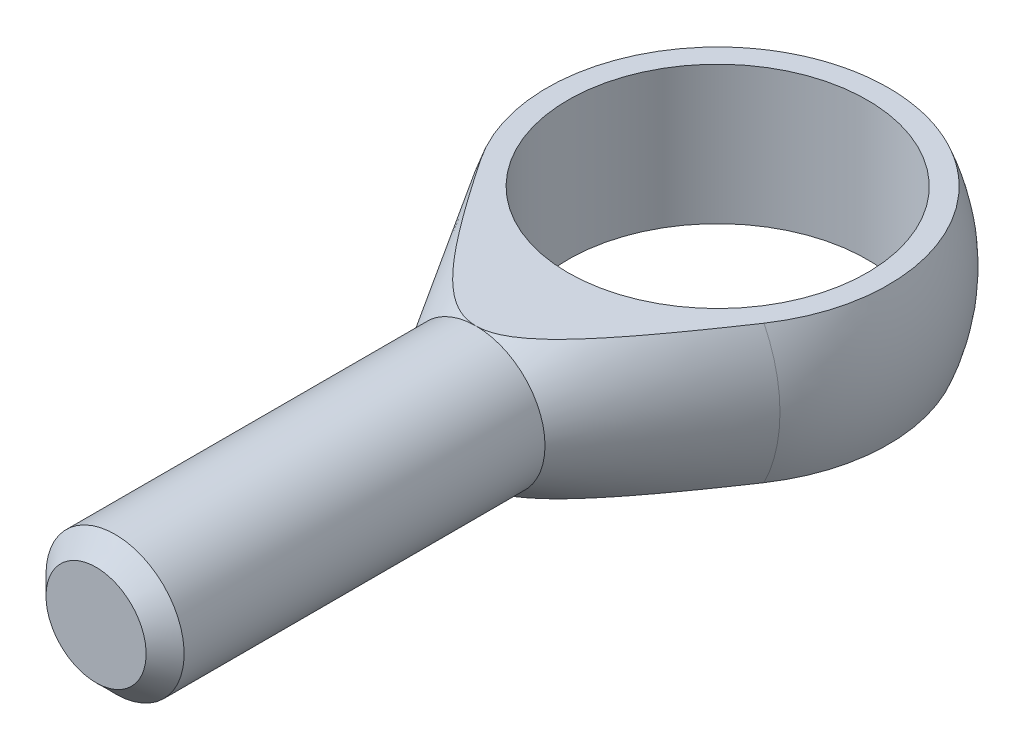
ISO-10303-21;
HEADER;
FILE_DESCRIPTION(('STEP AP214'),'2;1');
FILE_NAME('part.step','',(''),(''),'','','');
FILE_SCHEMA(('AUTOMOTIVE_DESIGN { 1 0 10303 214 1 1 1 1 }'));
ENDSEC;
DATA;
#1=APPLICATION_CONTEXT('core data for automotive mechanical design processes');
#2=APPLICATION_PROTOCOL_DEFINITION('international standard','automotive_design',2000,#1);
#3=PRODUCT_CONTEXT('',#1,'mechanical');
#4=PRODUCT('Part','Part','',(#3));
#5=PRODUCT_RELATED_PRODUCT_CATEGORY('part','',(#4));
#6=PRODUCT_DEFINITION_FORMATION('','',#4);
#7=PRODUCT_DEFINITION_CONTEXT('part definition',#1,'design');
#8=PRODUCT_DEFINITION('design','',#6,#7);
#9=PRODUCT_DEFINITION_SHAPE('','',#8);
#10=(LENGTH_UNIT() NAMED_UNIT(*) SI_UNIT(.MILLI.,.METRE.));
#11=(NAMED_UNIT(*) PLANE_ANGLE_UNIT() SI_UNIT($,.RADIAN.));
#12=(NAMED_UNIT(*) SI_UNIT($,.STERADIAN.) SOLID_ANGLE_UNIT());
#13=UNCERTAINTY_MEASURE_WITH_UNIT(LENGTH_MEASURE(1.E-05),#10,'distance_accuracy_value','');
#14=(GEOMETRIC_REPRESENTATION_CONTEXT(3) GLOBAL_UNCERTAINTY_ASSIGNED_CONTEXT((#13)) GLOBAL_UNIT_ASSIGNED_CONTEXT((#10,
#11,#12)) REPRESENTATION_CONTEXT('',''));
#15=CARTESIAN_POINT('',(0.,0.,0.));
#16=DIRECTION('',(0.,0.,1.));
#17=DIRECTION('',(1.,0.,0.));
#18=AXIS2_PLACEMENT_3D('',#15,#16,#17);
#19=CARTESIAN_POINT('',(0.,0.,21.));
#20=DIRECTION('',(0.,0.,-1.));
#21=DIRECTION('',(-1.,0.,0.));
#22=AXIS2_PLACEMENT_3D('',#19,#20,#21);
#23=CONICAL_SURFACE('',#22,6.,0.54381913603572);
#24=CARTESIAN_POINT('',(0.,0.,8.27852704456483));
#25=DIRECTION('',(0.,0.,-1.));
#26=DIRECTION('',(-1.,0.,0.));
#27=AXIS2_PLACEMENT_3D('',#24,#25,#26);
#28=CIRCLE('',#27,13.6918220106898);
#29=CARTESIAN_POINT('',(-12.3071519846148,-6.,8.27852704456483));
#30=VERTEX_POINT('',#29);
#31=CARTESIAN_POINT('',(-12.3071519846148,6.,8.27852704456483));
#32=VERTEX_POINT('',#31);
#33=EDGE_CURVE('E98',#30,#32,#28,.T.);
#34=ORIENTED_EDGE('',*,*,#33,.F.);
#35=CARTESIAN_POINT('',(-31.3799882104958,-6.,-21.9160405435385));
#36=CARTESIAN_POINT('',(-30.9346155893106,-6.,-21.1925500495504));
#37=CARTESIAN_POINT('',(-30.4890034582179,-6.,-20.4692070155686));
#38=CARTESIAN_POINT('',(-29.5972262334052,-6.,-19.022861540835));
#39=CARTESIAN_POINT('',(-29.1510611394851,-6.,-18.2998591002066));
#40=CARTESIAN_POINT('',(-27.8115766615616,-6.,-16.1313521166251));
#41=CARTESIAN_POINT('',(-26.9173172646921,-6.,-14.6864278449652));
#42=CARTESIAN_POINT('',(-25.1235923096148,-6.,-11.7956444903462));
#43=CARTESIAN_POINT('',(-24.2241197878063,-6.,-10.3497897269972));
#44=CARTESIAN_POINT('',(-22.4206158394495,-6.,-7.46102313765912));
#45=CARTESIAN_POINT('',(-21.5165846430345,-6.,-6.01811116817422));
#46=CARTESIAN_POINT('',(-20.126860696282,-6.,-3.81129437405455));
#47=CARTESIAN_POINT('',(-19.6435464141357,-6.,-3.04589194963399));
#48=CARTESIAN_POINT('',(-18.6745854110955,-6.,-1.51656533446917));
#49=CARTESIAN_POINT('',(-18.1889386929651,-6.,-0.75264114197502));
#50=CARTESIAN_POINT('',(-17.2146421972767,-6.,0.773463680413597));
#51=CARTESIAN_POINT('',(-16.7259919498118,-6.,1.53564401048951));
#52=CARTESIAN_POINT('',(-15.7449501334085,-6.,3.05758567398117));
#53=CARTESIAN_POINT('',(-15.2525585992186,-6.,3.81734702977121));
#54=CARTESIAN_POINT('',(-14.2634801806534,-6.,5.33272583238984));
#55=CARTESIAN_POINT('',(-13.766799392861,-6.,6.08834725487742));
#56=CARTESIAN_POINT('',(-12.7668366966786,-6.,7.59526672419474));
#57=CARTESIAN_POINT('',(-12.2635545265885,-6.,8.34656459791599));
#58=CARTESIAN_POINT('',(-11.5017822788204,-6.,9.46871748550414));
#59=CARTESIAN_POINT('',(-11.2467510177423,-6.,9.84192022113506));
#60=CARTESIAN_POINT('',(-10.7339025234583,-6.,10.5864052204217));
#61=CARTESIAN_POINT('',(-10.4760853093945,-6.,10.9576874972468));
#62=CARTESIAN_POINT('',(-9.95708575881299,-6.,11.6978551503882));
#63=CARTESIAN_POINT('',(-9.69590366612362,-6.,12.0667406974964));
#64=CARTESIAN_POINT('',(-9.16937247619287,-6.,12.8015219736493));
#65=CARTESIAN_POINT('',(-8.90402346502942,-6.,13.1674177642181));
#66=CARTESIAN_POINT('',(-8.460014194362,-6.,13.7704906969663));
#67=CARTESIAN_POINT('',(-8.28284323101851,-6.,14.0087640172321));
#68=CARTESIAN_POINT('',(-7.92583684483059,-6.,14.48331778095));
#69=CARTESIAN_POINT('',(-7.74600136081962,-6.,14.7195981784568));
#70=CARTESIAN_POINT('',(-7.38305426531327,-6.,15.1898992353419));
#71=CARTESIAN_POINT('',(-7.19994043221562,-6.,15.4239181830393));
#72=CARTESIAN_POINT('',(-6.82994411624043,-6.,15.8889550963289));
#73=CARTESIAN_POINT('',(-6.64306172541067,-6.,16.1199731349927));
#74=CARTESIAN_POINT('',(-6.26537430423413,-6.,16.577467845376));
#75=CARTESIAN_POINT('',(-6.07458481474136,-6.,16.803957312042));
#76=CARTESIAN_POINT('',(-5.68745941935048,-6.,17.2521406916316));
#77=CARTESIAN_POINT('',(-5.49112386393112,-6.,17.4738349060306));
#78=CARTESIAN_POINT('',(-5.09175015278233,-6.,17.910725013741));
#79=CARTESIAN_POINT('',(-4.88871884774234,-6.,18.125927142489));
#80=CARTESIAN_POINT('',(-4.47404371281153,-6.,18.5478259059901));
#81=CARTESIAN_POINT('',(-4.26240251355695,-6.,18.7545251004523));
#82=CARTESIAN_POINT('',(-3.88946376517466,-6.,19.0993151487996));
#83=CARTESIAN_POINT('',(-3.73084066141112,-6.,19.240287631417));
#84=CARTESIAN_POINT('',(-3.40674953052468,-6.,19.5143095980893));
#85=CARTESIAN_POINT('',(-3.24127918962299,-6.,19.6473563662652));
#86=CARTESIAN_POINT('',(-2.90281116121088,-6.,19.9024579565511));
#87=CARTESIAN_POINT('',(-2.72983943598837,-6.,20.024546803352));
#88=CARTESIAN_POINT('',(-2.37476302906092,-6.,20.2544269996832));
#89=CARTESIAN_POINT('',(-2.19266585087034,-6.,20.3622298385993));
#90=CARTESIAN_POINT('',(-1.7965747978339,-6.,20.5698544641381));
#91=CARTESIAN_POINT('',(-1.58131425638325,-6.,20.6673552282702));
#92=CARTESIAN_POINT('',(-1.24943088724608,-6.,20.7886986837656));
#93=CARTESIAN_POINT('',(-1.13732563638951,-6.,20.8249908644043));
#94=CARTESIAN_POINT('',(-0.910500826215442,-6.,20.8880927750263));
#95=CARTESIAN_POINT('',(-0.795782675289699,-6.,20.91490749051));
#96=CARTESIAN_POINT('',(-0.562915670696806,-6.,20.9582813929463));
#97=CARTESIAN_POINT('',(-0.444741850116909,-6.,20.9747080433463));
#98=CARTESIAN_POINT('',(-0.207353172159811,-6.,20.9960101114955));
#99=CARTESIAN_POINT('',(-0.0881383988865509,-6.,21.0008864539429));
#100=CARTESIAN_POINT('',(0.150170722889329,-6.,20.9988483726897));
#101=CARTESIAN_POINT('',(0.269265087453287,-6.,20.991935813276));
#102=CARTESIAN_POINT('',(0.506229209827387,-6.,20.9666640842946));
#103=CARTESIAN_POINT('',(0.624098810252515,-6.,20.9483034616746));
#104=CARTESIAN_POINT('',(0.870063607691504,-6.,20.8984503753296));
#105=CARTESIAN_POINT('',(0.997916706362346,-6.,20.865771218156));
#106=CARTESIAN_POINT('',(1.25014820189205,-6.,20.7889631603308));
#107=CARTESIAN_POINT('',(1.37452498767296,-6.,20.7448290453001));
#108=CARTESIAN_POINT('',(1.61959187065122,-6.,20.6467170078992));
#109=CARTESIAN_POINT('',(1.74027380218476,-6.,20.5927188950233));
#110=CARTESIAN_POINT('',(1.97759984990636,-6.,20.4765579671671));
#111=CARTESIAN_POINT('',(2.0942440478626,-6.,20.4143953176493));
#112=CARTESIAN_POINT('',(2.34728797757201,-6.,20.2698082894266));
#113=CARTESIAN_POINT('',(2.48280610860327,-6.,20.1858481797006));
#114=CARTESIAN_POINT('',(2.7486994638737,-6.,20.0101070576492));
#115=CARTESIAN_POINT('',(2.87907259019253,-6.,19.9183229022359));
#116=CARTESIAN_POINT('',(3.13537706565216,-6.,19.728388023541));
#117=CARTESIAN_POINT('',(3.26130133672617,-6.,19.6302278032431));
#118=CARTESIAN_POINT('',(3.50906304279529,-6.,19.4288721941432));
#119=CARTESIAN_POINT('',(3.63089995524097,-6.,19.3256761656454));
#120=CARTESIAN_POINT('',(3.87181155020788,-6.,19.1144634557711));
#121=CARTESIAN_POINT('',(3.99086110302297,-6.,19.0064182196495));
#122=CARTESIAN_POINT('',(4.22576989320534,-6.,18.7869184222835));
#123=CARTESIAN_POINT('',(4.34162904722421,-6.,18.6754637721292));
#124=CARTESIAN_POINT('',(4.57043082921461,-6.,18.4498409654308));
#125=CARTESIAN_POINT('',(4.68337635623869,-6.,18.3356757417746));
#126=CARTESIAN_POINT('',(4.90680448753394,-6.,18.1049746094091));
#127=CARTESIAN_POINT('',(5.01728718070854,-6.,17.9884387865651));
#128=CARTESIAN_POINT('',(5.36612173955582,-6.,17.6136742787642));
#129=CARTESIAN_POINT('',(5.60039459573932,-6.,17.351645352019));
#130=CARTESIAN_POINT('',(6.06102141083565,-6.,16.8206958939175));
#131=CARTESIAN_POINT('',(6.28737396203295,-6.,16.5517741520343));
#132=CARTESIAN_POINT('',(6.73394561712576,-6.,16.0086519655853));
#133=CARTESIAN_POINT('',(6.95416129148376,-6.,15.7344487087099));
#134=CARTESIAN_POINT('',(7.38959022012685,-6.,15.1820958625112));
#135=CARTESIAN_POINT('',(7.60480329932923,-6.,14.9039461356149));
#136=CARTESIAN_POINT('',(8.03161304260166,-6.,14.3439535338031));
#137=CARTESIAN_POINT('',(8.24320101632604,-6.,14.0621040483462));
#138=CARTESIAN_POINT('',(8.66301230278849,-6.,13.4959083591818));
#139=CARTESIAN_POINT('',(8.87123556827255,-6.,13.2115621204962));
#140=CARTESIAN_POINT('',(9.28480487958707,-6.,12.6409339975004));
#141=CARTESIAN_POINT('',(9.49015187484745,-6.,12.3546528004816));
#142=CARTESIAN_POINT('',(9.89847885118036,-6.,11.7804061382996));
#143=CARTESIAN_POINT('',(10.1014588147406,-6.,11.492440660699));
#144=CARTESIAN_POINT('',(10.7070127814102,-6.,10.6269859232812));
#145=CARTESIAN_POINT('',(11.106589327327,-6.,10.047399243146));
#146=CARTESIAN_POINT('',(11.8998426580399,-6.,8.88414957701882));
#147=CARTESIAN_POINT('',(12.293518981256,-6.,8.30048627729143));
#148=CARTESIAN_POINT('',(13.0758336013582,-6.,7.13085972480483));
#149=CARTESIAN_POINT('',(13.4644776187565,-6.,6.54490029437336));
#150=CARTESIAN_POINT('',(14.2382073625244,-6.,5.37066039390251));
#151=CARTESIAN_POINT('',(14.62329317672,-6.,4.78237998166535));
#152=CARTESIAN_POINT('',(15.3585771337857,-6.,3.65320122392585));
#153=CARTESIAN_POINT('',(15.7090021166038,-6.,3.11245047524019));
#154=CARTESIAN_POINT('',(16.4078846217464,-6.,2.02967869372597));
#155=CARTESIAN_POINT('',(16.7563421413753,-6.,1.48765765915846));
#156=CARTESIAN_POINT('',(17.7992758967793,-6.,-0.139985997389402));
#157=CARTESIAN_POINT('',(18.491305096419,-6.,-1.22717649251654));
#158=CARTESIAN_POINT('',(19.8710458348003,-6.,-3.40507585619151));
#159=CARTESIAN_POINT('',(20.5587549599765,-6.,-4.4957862514136));
#160=CARTESIAN_POINT('',(21.9306838432565,-6.,-6.67940044412453));
#161=CARTESIAN_POINT('',(22.614903596599,-6.,-7.77230424460346));
#162=CARTESIAN_POINT('',(23.9754505739948,-6.,-9.95140679246916));
#163=CARTESIAN_POINT('',(24.6517981283151,-6.,-11.0375928533262));
#164=CARTESIAN_POINT('',(26.0024350837802,-6.,-13.2112462075492));
#165=CARTESIAN_POINT('',(26.6767244811887,-6.,-14.2987135032362));
#166=CARTESIAN_POINT('',(28.0232688371092,-6.,-16.474024708846));
#167=CARTESIAN_POINT('',(28.6955247567213,-6.,-17.5618680240207));
#168=CARTESIAN_POINT('',(30.0386913186117,-6.,-19.7383803061851));
#169=CARTESIAN_POINT('',(30.7096019650269,-6.,-20.8270492706215));
#170=CARTESIAN_POINT('',(31.3799882104958,-6.,-21.9160405435385));
#171=B_SPLINE_CURVE_WITH_KNOTS('',3,(#35,#36,#37,#38,#39,#40,#41,#42,#43,#44,#45,#46,#47,#48,
#49,#50,#51,#52,#53,#54,#55,#56,#57,#58,#59,#60,#61,#62,#63,#64,#65,#66,#67,#68,#69,#70,#71,#72,
#73,#74,#75,#76,#77,#78,#79,#80,#81,#82,#83,#84,#85,#86,#87,#88,#89,#90,#91,#92,#93,#94,#95,#96,
#97,#98,#99,#100,#101,#102,#103,#104,#105,#106,#107,#108,#109,#110,#111,#112,#113,#114,#115,
#116,#117,#118,#119,#120,#121,#122,#123,#124,#125,#126,#127,#128,#129,#130,#131,#132,#133,#134,
#135,#136,#137,#138,#139,#140,#141,#142,#143,#144,#145,#146,#147,#148,#149,#150,#151,#152,#153,
#154,#155,#156,#157,#158,#159,#160,#161,#162,#163,#164,#165,#166,#167,#168,#169,#170),
.UNSPECIFIED.,.F.,.F.,(4,2,2,2,2,2,2,2,2,2,2,2,2,2,2,2,2,2,2,2,2,2,2,2,2,2,2,2,2,2,2,2,2,2,2,2,
2,2,2,2,2,2,2,2,2,2,2,2,2,2,2,2,2,2,2,2,2,2,2,2,2,2,2,2,2,2,2,4),(0.,2.54875593193632,
5.09751278693731,10.1953080539329,15.3037194775998,20.4118755473142,23.1275494787357,
25.8432201934323,28.5593271800134,31.2754089705693,33.9881162986551,36.7009314942169,
38.0569789987539,39.4130171918848,40.7689576693249,42.1248701732329,43.0156265925406,
43.9064034917678,44.7978087762971,45.689192314384,46.5775376812096,47.4658270348714,
48.3532341405091,49.240372117877,49.8768137316226,50.5134721929115,51.148079979075,
51.7821742498355,52.4887532523772,52.8419137574872,53.1948882095245,53.5522797734834,
53.9096427243062,54.2669491672919,54.6243009708509,55.0195714569588,55.4150221895645,
55.8112916253154,56.2075530315105,56.685462870433,57.1635656090708,57.642397568746,
58.1212905133223,58.6035168332439,59.085755739283,59.5674947065795,60.0492162558008,
61.1034322397133,62.1578346526929,63.2128149498721,64.267832114227,65.3250990205127,
66.3823807621877,67.4393048652418,68.4962367829284,70.6081073333659,72.7201422440188,
74.829517243714,76.9388400385749,78.8719365042182,80.8050356177013,84.6712791975568,
88.5395188314093,92.4077637421059,96.246408577892,100.085060377907,103.921461286108,
107.757850378947),.UNSPECIFIED.);
#172=CARTESIAN_POINT('',(0.,-6.,21.));
#173=VERTEX_POINT('',#172);
#174=EDGE_CURVE('E94',#30,#173,#171,.T.);
#175=ORIENTED_EDGE('',*,*,#174,.T.);
#176=CARTESIAN_POINT('',(0.,0.,21.));
#177=DIRECTION('',(0.,0.,-1.));
#178=DIRECTION('',(-1.,0.,0.));
#179=AXIS2_PLACEMENT_3D('',#176,#177,#178);
#180=CIRCLE('',#179,6.);
#181=CARTESIAN_POINT('',(0.,6.,21.));
#182=VERTEX_POINT('',#181);
#183=EDGE_CURVE('E93',#173,#182,#180,.T.);
#184=ORIENTED_EDGE('',*,*,#183,.T.);
#185=CARTESIAN_POINT('',(31.3799882104958,6.,-21.9160405435385));
#186=CARTESIAN_POINT('',(30.9346155893106,6.,-21.1925500495504));
#187=CARTESIAN_POINT('',(30.4890034582179,6.,-20.4692070155686));
#188=CARTESIAN_POINT('',(29.5972262334052,6.,-19.022861540835));
#189=CARTESIAN_POINT('',(29.1510611394851,6.,-18.2998591002066));
#190=CARTESIAN_POINT('',(27.8115766615616,6.,-16.1313521166251));
#191=CARTESIAN_POINT('',(26.9173172646921,6.,-14.6864278449652));
#192=CARTESIAN_POINT('',(25.1235923096148,6.,-11.7956444903462));
#193=CARTESIAN_POINT('',(24.2241197878063,6.,-10.3497897269972));
#194=CARTESIAN_POINT('',(22.4206158394495,6.,-7.46102313765912));
#195=CARTESIAN_POINT('',(21.5165846430345,6.,-6.01811116817422));
#196=CARTESIAN_POINT('',(20.126860696282,6.,-3.81129437405455));
#197=CARTESIAN_POINT('',(19.6435464141357,6.,-3.04589194963399));
#198=CARTESIAN_POINT('',(18.6745854110955,6.,-1.51656533446917));
#199=CARTESIAN_POINT('',(18.1889386929651,6.,-0.75264114197502));
#200=CARTESIAN_POINT('',(17.2146421972767,6.,0.773463680413597));
#201=CARTESIAN_POINT('',(16.7259919498118,6.,1.53564401048951));
#202=CARTESIAN_POINT('',(15.7449501334085,6.,3.05758567398117));
#203=CARTESIAN_POINT('',(15.2525585992186,6.,3.81734702977121));
#204=CARTESIAN_POINT('',(14.2634801806534,6.,5.33272583238984));
#205=CARTESIAN_POINT('',(13.766799392861,6.,6.08834725487742));
#206=CARTESIAN_POINT('',(12.7668366966786,6.,7.59526672419474));
#207=CARTESIAN_POINT('',(12.2635545265885,6.,8.34656459791599));
#208=CARTESIAN_POINT('',(11.5017822788204,6.,9.46871748550414));
#209=CARTESIAN_POINT('',(11.2467510177423,6.,9.84192022113506));
#210=CARTESIAN_POINT('',(10.7339025234583,6.,10.5864052204217));
#211=CARTESIAN_POINT('',(10.4760853093945,6.,10.9576874972468));
#212=CARTESIAN_POINT('',(9.95708575881299,6.,11.6978551503882));
#213=CARTESIAN_POINT('',(9.69590366612362,6.,12.0667406974964));
#214=CARTESIAN_POINT('',(9.16937247619287,6.,12.8015219736493));
#215=CARTESIAN_POINT('',(8.90402346502942,6.,13.1674177642181));
#216=CARTESIAN_POINT('',(8.460014194362,6.,13.7704906969663));
#217=CARTESIAN_POINT('',(8.28284323101851,6.,14.0087640172321));
#218=CARTESIAN_POINT('',(7.92583684483059,6.,14.48331778095));
#219=CARTESIAN_POINT('',(7.74600136081962,6.,14.7195981784568));
#220=CARTESIAN_POINT('',(7.38305426531327,6.,15.1898992353419));
#221=CARTESIAN_POINT('',(7.19994043221562,6.,15.4239181830393));
#222=CARTESIAN_POINT('',(6.82994411624043,6.,15.8889550963289));
#223=CARTESIAN_POINT('',(6.64306172541067,6.,16.1199731349927));
#224=CARTESIAN_POINT('',(6.26537430423413,6.,16.577467845376));
#225=CARTESIAN_POINT('',(6.07458481474136,6.,16.803957312042));
#226=CARTESIAN_POINT('',(5.68745941935048,6.,17.2521406916316));
#227=CARTESIAN_POINT('',(5.49112386393112,6.,17.4738349060306));
#228=CARTESIAN_POINT('',(5.09175015278233,6.,17.910725013741));
#229=CARTESIAN_POINT('',(4.88871884774234,6.,18.125927142489));
#230=CARTESIAN_POINT('',(4.47404371281153,6.,18.5478259059901));
#231=CARTESIAN_POINT('',(4.26240251355695,6.,18.7545251004523));
#232=CARTESIAN_POINT('',(3.88946376517466,6.,19.0993151487996));
#233=CARTESIAN_POINT('',(3.73084066141112,6.,19.240287631417));
#234=CARTESIAN_POINT('',(3.40674953052468,6.,19.5143095980893));
#235=CARTESIAN_POINT('',(3.24127918962299,6.,19.6473563662652));
#236=CARTESIAN_POINT('',(2.90281116121088,6.,19.9024579565511));
#237=CARTESIAN_POINT('',(2.72983943598837,6.,20.024546803352));
#238=CARTESIAN_POINT('',(2.37476302906092,6.,20.2544269996832));
#239=CARTESIAN_POINT('',(2.19266585087034,6.,20.3622298385993));
#240=CARTESIAN_POINT('',(1.7965747978339,6.,20.5698544641381));
#241=CARTESIAN_POINT('',(1.58131425638325,6.,20.6673552282702));
#242=CARTESIAN_POINT('',(1.24943088724608,6.,20.7886986837656));
#243=CARTESIAN_POINT('',(1.13732563638951,6.,20.8249908644043));
#244=CARTESIAN_POINT('',(0.910500826215442,6.,20.8880927750263));
#245=CARTESIAN_POINT('',(0.795782675289699,6.,20.91490749051));
#246=CARTESIAN_POINT('',(0.562915670696806,6.,20.9582813929463));
#247=CARTESIAN_POINT('',(0.444741850116909,6.,20.9747080433463));
#248=CARTESIAN_POINT('',(0.207353172159811,6.,20.9960101114955));
#249=CARTESIAN_POINT('',(0.0881383988865509,6.,21.0008864539429));
#250=CARTESIAN_POINT('',(-0.150170722889329,6.,20.9988483726897));
#251=CARTESIAN_POINT('',(-0.269265087453287,6.,20.991935813276));
#252=CARTESIAN_POINT('',(-0.506229209827387,6.,20.9666640842946));
#253=CARTESIAN_POINT('',(-0.624098810252515,6.,20.9483034616746));
#254=CARTESIAN_POINT('',(-0.870063607691504,6.,20.8984503753296));
#255=CARTESIAN_POINT('',(-0.997916706362346,6.,20.865771218156));
#256=CARTESIAN_POINT('',(-1.25014820189205,6.,20.7889631603308));
#257=CARTESIAN_POINT('',(-1.37452498767296,6.,20.7448290453001));
#258=CARTESIAN_POINT('',(-1.61959187065122,6.,20.6467170078992));
#259=CARTESIAN_POINT('',(-1.74027380218476,6.,20.5927188950233));
#260=CARTESIAN_POINT('',(-1.97759984990636,6.,20.4765579671671));
#261=CARTESIAN_POINT('',(-2.0942440478626,6.,20.4143953176493));
#262=CARTESIAN_POINT('',(-2.34728797757201,6.,20.2698082894266));
#263=CARTESIAN_POINT('',(-2.48280610860327,6.,20.1858481797006));
#264=CARTESIAN_POINT('',(-2.7486994638737,6.,20.0101070576492));
#265=CARTESIAN_POINT('',(-2.87907259019253,6.,19.9183229022359));
#266=CARTESIAN_POINT('',(-3.13537706565216,6.,19.728388023541));
#267=CARTESIAN_POINT('',(-3.26130133672617,6.,19.6302278032431));
#268=CARTESIAN_POINT('',(-3.50906304279529,6.,19.4288721941432));
#269=CARTESIAN_POINT('',(-3.63089995524097,6.,19.3256761656454));
#270=CARTESIAN_POINT('',(-3.87181155020788,6.,19.1144634557711));
#271=CARTESIAN_POINT('',(-3.99086110302297,6.,19.0064182196495));
#272=CARTESIAN_POINT('',(-4.22576989320534,6.,18.7869184222835));
#273=CARTESIAN_POINT('',(-4.34162904722421,6.,18.6754637721292));
#274=CARTESIAN_POINT('',(-4.57043082921461,6.,18.4498409654308));
#275=CARTESIAN_POINT('',(-4.68337635623869,6.,18.3356757417746));
#276=CARTESIAN_POINT('',(-4.90680448753394,6.,18.1049746094091));
#277=CARTESIAN_POINT('',(-5.01728718070854,6.,17.9884387865651));
#278=CARTESIAN_POINT('',(-5.36612173955582,6.,17.6136742787642));
#279=CARTESIAN_POINT('',(-5.60039459573932,6.,17.351645352019));
#280=CARTESIAN_POINT('',(-6.06102141083565,6.,16.8206958939175));
#281=CARTESIAN_POINT('',(-6.28737396203295,6.,16.5517741520343));
#282=CARTESIAN_POINT('',(-6.73394561712576,6.,16.0086519655853));
#283=CARTESIAN_POINT('',(-6.95416129148376,6.,15.7344487087099));
#284=CARTESIAN_POINT('',(-7.38959022012685,6.,15.1820958625112));
#285=CARTESIAN_POINT('',(-7.60480329932923,6.,14.9039461356149));
#286=CARTESIAN_POINT('',(-8.03161304260166,6.,14.3439535338031));
#287=CARTESIAN_POINT('',(-8.24320101632604,6.,14.0621040483462));
#288=CARTESIAN_POINT('',(-8.66301230278849,6.,13.4959083591818));
#289=CARTESIAN_POINT('',(-8.87123556827255,6.,13.2115621204962));
#290=CARTESIAN_POINT('',(-9.28480487958707,6.,12.6409339975004));
#291=CARTESIAN_POINT('',(-9.49015187484745,6.,12.3546528004816));
#292=CARTESIAN_POINT('',(-9.89847885118036,6.,11.7804061382996));
#293=CARTESIAN_POINT('',(-10.1014588147406,6.,11.492440660699));
#294=CARTESIAN_POINT('',(-10.7070127814102,6.,10.6269859232812));
#295=CARTESIAN_POINT('',(-11.106589327327,6.,10.047399243146));
#296=CARTESIAN_POINT('',(-11.8998426580399,6.,8.88414957701882));
#297=CARTESIAN_POINT('',(-12.293518981256,6.,8.30048627729143));
#298=CARTESIAN_POINT('',(-13.0758336013582,6.,7.13085972480483));
#299=CARTESIAN_POINT('',(-13.4644776187565,6.,6.54490029437336));
#300=CARTESIAN_POINT('',(-14.2382073625244,6.,5.37066039390251));
#301=CARTESIAN_POINT('',(-14.62329317672,6.,4.78237998166535));
#302=CARTESIAN_POINT('',(-15.3585771337857,6.,3.65320122392585));
#303=CARTESIAN_POINT('',(-15.7090021166038,6.,3.11245047524019));
#304=CARTESIAN_POINT('',(-16.4078846217464,6.,2.02967869372597));
#305=CARTESIAN_POINT('',(-16.7563421413753,6.,1.48765765915846));
#306=CARTESIAN_POINT('',(-17.7992758967793,6.,-0.139985997389402));
#307=CARTESIAN_POINT('',(-18.491305096419,6.,-1.22717649251654));
#308=CARTESIAN_POINT('',(-19.8710458348003,6.,-3.40507585619151));
#309=CARTESIAN_POINT('',(-20.5587549599765,6.,-4.4957862514136));
#310=CARTESIAN_POINT('',(-21.9306838432565,6.,-6.67940044412453));
#311=CARTESIAN_POINT('',(-22.614903596599,6.,-7.77230424460346));
#312=CARTESIAN_POINT('',(-23.9754505739948,6.,-9.95140679246916));
#313=CARTESIAN_POINT('',(-24.6517981283151,6.,-11.0375928533262));
#314=CARTESIAN_POINT('',(-26.0024350837802,6.,-13.2112462075492));
#315=CARTESIAN_POINT('',(-26.6767244811887,6.,-14.2987135032362));
#316=CARTESIAN_POINT('',(-28.0232688371092,6.,-16.474024708846));
#317=CARTESIAN_POINT('',(-28.6955247567213,6.,-17.5618680240207));
#318=CARTESIAN_POINT('',(-30.0386913186117,6.,-19.7383803061851));
#319=CARTESIAN_POINT('',(-30.7096019650269,6.,-20.8270492706215));
#320=CARTESIAN_POINT('',(-31.3799882104958,6.,-21.9160405435385));
#321=B_SPLINE_CURVE_WITH_KNOTS('',3,(#185,#186,#187,#188,#189,#190,#191,#192,#193,#194,#195,
#196,#197,#198,#199,#200,#201,#202,#203,#204,#205,#206,#207,#208,#209,#210,#211,#212,#213,#214,
#215,#216,#217,#218,#219,#220,#221,#222,#223,#224,#225,#226,#227,#228,#229,#230,#231,#232,#233,
#234,#235,#236,#237,#238,#239,#240,#241,#242,#243,#244,#245,#246,#247,#248,#249,#250,#251,#252,
#253,#254,#255,#256,#257,#258,#259,#260,#261,#262,#263,#264,#265,#266,#267,#268,#269,#270,#271,
#272,#273,#274,#275,#276,#277,#278,#279,#280,#281,#282,#283,#284,#285,#286,#287,#288,#289,#290,
#291,#292,#293,#294,#295,#296,#297,#298,#299,#300,#301,#302,#303,#304,#305,#306,#307,#308,#309,
#310,#311,#312,#313,#314,#315,#316,#317,#318,#319,#320),.UNSPECIFIED.,.F.,.F.,(4,2,2,2,2,2,2,2,
2,2,2,2,2,2,2,2,2,2,2,2,2,2,2,2,2,2,2,2,2,2,2,2,2,2,2,2,2,2,2,2,2,2,2,2,2,2,2,2,2,2,2,2,2,2,2,2,
2,2,2,2,2,2,2,2,2,2,2,4),(0.,2.54875593193632,5.09751278693731,10.1953080539329,
15.3037194775998,20.4118755473142,23.1275494787357,25.8432201934323,28.5593271800134,
31.2754089705693,33.9881162986551,36.7009314942169,38.0569789987539,39.4130171918848,
40.7689576693249,42.1248701732329,43.0156265925406,43.9064034917678,44.7978087762971,
45.689192314384,46.5775376812096,47.4658270348714,48.3532341405091,49.240372117877,
49.8768137316226,50.5134721929115,51.148079979075,51.7821742498355,52.4887532523772,
52.8419137574872,53.1948882095245,53.5522797734834,53.9096427243062,54.2669491672919,
54.6243009708509,55.0195714569588,55.4150221895645,55.8112916253154,56.2075530315105,
56.685462870433,57.1635656090708,57.642397568746,58.1212905133223,58.6035168332439,
59.085755739283,59.5674947065795,60.0492162558008,61.1034322397133,62.1578346526929,
63.2128149498721,64.267832114227,65.3250990205127,66.3823807621877,67.4393048652418,
68.4962367829284,70.6081073333659,72.7201422440188,74.829517243714,76.9388400385749,
78.8719365042182,80.8050356177013,84.6712791975568,88.5395188314093,92.4077637421059,
96.246408577892,100.085060377907,103.921461286108,107.757850378947),.UNSPECIFIED.);
#322=EDGE_CURVE('E73',#182,#32,#321,.T.);
#323=ORIENTED_EDGE('',*,*,#322,.T.);
#324=EDGE_LOOP('',(#34,#175,#184,#323));
#325=FACE_BOUND('',#324,.T.);
#326=ADVANCED_FACE('F38',(#325),#23,.T.);
#327=EDGE_CURVE('E88',#182,#173,#180,.T.);
#328=ORIENTED_EDGE('',*,*,#327,.T.);
#329=CARTESIAN_POINT('',(12.3071519846148,-6.,8.27852704456483));
#330=VERTEX_POINT('',#329);
#331=EDGE_CURVE('E90',#173,#330,#171,.T.);
#332=ORIENTED_EDGE('',*,*,#331,.T.);
#333=CARTESIAN_POINT('',(12.3071519846148,6.,8.27852704456483));
#334=VERTEX_POINT('',#333);
#335=EDGE_CURVE('E89',#334,#330,#28,.T.);
#336=ORIENTED_EDGE('',*,*,#335,.F.);
#337=EDGE_CURVE('E76',#334,#182,#321,.T.);
#338=ORIENTED_EDGE('',*,*,#337,.T.);
#339=EDGE_LOOP('',(#328,#332,#336,#338));
#340=FACE_BOUND('',#339,.T.);
#341=ADVANCED_FACE('F86',(#340),#23,.T.);
#342=CARTESIAN_POINT('',(0.,0.,0.));
#343=DIRECTION('',(0.,0.,-1.));
#344=DIRECTION('',(1.,0.,0.));
#345=AXIS2_PLACEMENT_3D('',#342,#343,#344);
#346=SPHERICAL_SURFACE('',#345,16.);
#347=CARTESIAN_POINT('',(0.,-6.,0.));
#348=DIRECTION('',(0.,1.,0.));
#349=DIRECTION('',(0.,0.,1.));
#350=AXIS2_PLACEMENT_3D('',#347,#348,#349);
#351=CIRCLE('',#350,14.8323969741913);
#352=EDGE_CURVE('E54',#330,#30,#351,.T.);
#353=ORIENTED_EDGE('',*,*,#352,.T.);
#354=ORIENTED_EDGE('',*,*,#33,.T.);
#355=CARTESIAN_POINT('',(0.,6.,0.));
#356=DIRECTION('',(0.,-1.,0.));
#357=DIRECTION('',(0.,0.,-1.));
#358=AXIS2_PLACEMENT_3D('',#355,#356,#357);
#359=CIRCLE('',#358,14.8323969741913);
#360=EDGE_CURVE('E78',#32,#334,#359,.T.);
#361=ORIENTED_EDGE('',*,*,#360,.T.);
#362=ORIENTED_EDGE('',*,*,#335,.T.);
#363=EDGE_LOOP('',(#353,#354,#361,#362));
#364=FACE_BOUND('',#363,.T.);
#365=ADVANCED_FACE('F126',(#364),#346,.T.);
#366=CARTESIAN_POINT('',(0.,0.,54.));
#367=DIRECTION('',(0.,0.,-1.));
#368=DIRECTION('',(-1.,0.,0.));
#369=AXIS2_PLACEMENT_3D('',#366,#367,#368);
#370=PLANE('',#369);
#371=CARTESIAN_POINT('',(0.,0.,54.));
#372=DIRECTION('',(0.,0.,-1.));
#373=DIRECTION('',(-1.,0.,0.));
#374=AXIS2_PLACEMENT_3D('',#371,#372,#373);
#375=CIRCLE('',#374,4.34999999999998);
#376=CARTESIAN_POINT('',(-4.34999999999998,0.,54.));
#377=VERTEX_POINT('',#376);
#378=EDGE_CURVE('E11',#377,#377,#375,.F.);
#379=ORIENTED_EDGE('',*,*,#378,.T.);
#380=EDGE_LOOP('',(#379));
#381=FACE_BOUND('',#380,.T.);
#382=ADVANCED_FACE('F144',(#381),#370,.F.);
#383=CARTESIAN_POINT('',(0.,0.,-26.0435164980697));
#384=DIRECTION('',(0.,0.,-1.));
#385=DIRECTION('',(-1.,0.,0.));
#386=AXIS2_PLACEMENT_3D('',#383,#384,#385);
#387=CYLINDRICAL_SURFACE('',#386,6.);
#388=CARTESIAN_POINT('',(0.,0.,52.35));
#389=DIRECTION('',(0.,0.,-1.));
#390=DIRECTION('',(-1.,0.,0.));
#391=AXIS2_PLACEMENT_3D('',#388,#389,#390);
#392=CIRCLE('',#391,6.);
#393=CARTESIAN_POINT('',(-6.,0.,52.35));
#394=VERTEX_POINT('',#393);
#395=EDGE_CURVE('E47',#394,#394,#392,.T.);
#396=ORIENTED_EDGE('',*,*,#395,.T.);
#397=EDGE_LOOP('',(#396));
#398=FACE_BOUND('',#397,.T.);
#399=ORIENTED_EDGE('',*,*,#327,.F.);
#400=ORIENTED_EDGE('',*,*,#183,.F.);
#401=EDGE_LOOP('',(#399,#400));
#402=FACE_BOUND('',#401,.T.);
#403=ADVANCED_FACE('F97',(#398,#402),#387,.T.);
#404=CARTESIAN_POINT('',(-16.,6.,21.));
#405=DIRECTION('',(0.,-1.,0.));
#406=DIRECTION('',(0.,0.,-1.));
#407=AXIS2_PLACEMENT_3D('',#404,#405,#406);
#408=PLANE('',#407);
#409=CARTESIAN_POINT('',(0.,6.00000000000001,0.));
#410=DIRECTION('',(0.,1.,0.));
#411=DIRECTION('',(0.,0.,1.));
#412=AXIS2_PLACEMENT_3D('',#409,#410,#411);
#413=CIRCLE('',#412,13.);
#414=CARTESIAN_POINT('',(0.,6.00000000000001,13.));
#415=VERTEX_POINT('',#414);
#416=EDGE_CURVE('E202',#415,#415,#413,.T.);
#417=ORIENTED_EDGE('',*,*,#416,.F.);
#418=EDGE_LOOP('',(#417));
#419=FACE_BOUND('',#418,.T.);
#420=ORIENTED_EDGE('',*,*,#337,.F.);
#421=ORIENTED_EDGE('',*,*,#360,.F.);
#422=ORIENTED_EDGE('',*,*,#322,.F.);
#423=EDGE_LOOP('',(#420,#421,#422));
#424=FACE_BOUND('',#423,.T.);
#425=ADVANCED_FACE('F75',(#419,#424),#408,.F.);
#426=CARTESIAN_POINT('',(-16.,-6.,21.));
#427=DIRECTION('',(0.,1.,0.));
#428=DIRECTION('',(0.,0.,1.));
#429=AXIS2_PLACEMENT_3D('',#426,#427,#428);
#430=PLANE('',#429);
#431=CARTESIAN_POINT('',(0.,-6.00000000000001,0.));
#432=DIRECTION('',(0.,1.,0.));
#433=DIRECTION('',(0.,0.,1.));
#434=AXIS2_PLACEMENT_3D('',#431,#432,#433);
#435=CIRCLE('',#434,13.);
#436=CARTESIAN_POINT('',(0.,-6.00000000000001,13.));
#437=VERTEX_POINT('',#436);
#438=EDGE_CURVE('E82',#437,#437,#435,.T.);
#439=ORIENTED_EDGE('',*,*,#438,.T.);
#440=EDGE_LOOP('',(#439));
#441=FACE_BOUND('',#440,.T.);
#442=ORIENTED_EDGE('',*,*,#174,.F.);
#443=ORIENTED_EDGE('',*,*,#352,.F.);
#444=ORIENTED_EDGE('',*,*,#331,.F.);
#445=EDGE_LOOP('',(#442,#443,#444));
#446=FACE_BOUND('',#445,.T.);
#447=ADVANCED_FACE('F118',(#441,#446),#430,.F.);
#448=CARTESIAN_POINT('',(0.,-6.00000000000001,0.));
#449=DIRECTION('',(0.,1.,0.));
#450=DIRECTION('',(0.,0.,1.));
#451=AXIS2_PLACEMENT_3D('',#448,#449,#450);
#452=CYLINDRICAL_SURFACE('',#451,13.);
#453=ORIENTED_EDGE('',*,*,#438,.F.);
#454=EDGE_LOOP('',(#453));
#455=FACE_BOUND('',#454,.T.);
#456=ORIENTED_EDGE('',*,*,#416,.T.);
#457=EDGE_LOOP('',(#456));
#458=FACE_BOUND('',#457,.T.);
#459=ADVANCED_FACE('F113',(#455,#458),#452,.F.);
#460=CARTESIAN_POINT('',(0.,0.,52.35));
#461=DIRECTION('',(0.,0.,-1.));
#462=DIRECTION('',(-1.,0.,0.));
#463=AXIS2_PLACEMENT_3D('',#460,#461,#462);
#464=CONICAL_SURFACE('',#463,6.,0.785398163397454);
#465=ORIENTED_EDGE('',*,*,#378,.F.);
#466=EDGE_LOOP('',(#465));
#467=FACE_BOUND('',#466,.T.);
#468=ORIENTED_EDGE('',*,*,#395,.F.);
#469=EDGE_LOOP('',(#468));
#470=FACE_BOUND('',#469,.T.);
#471=ADVANCED_FACE('F41',(#467,#470),#464,.T.);
#472=CLOSED_SHELL('',(#326,#341,#365,#382,#403,#425,#447,#459,#471));
#473=MANIFOLD_SOLID_BREP('B2',#472);
#474=ADVANCED_BREP_SHAPE_REPRESENTATION('',(#18,#473),#14);
#475=SHAPE_DEFINITION_REPRESENTATION(#9,#474);
ENDSEC;
END-ISO-10303-21;
